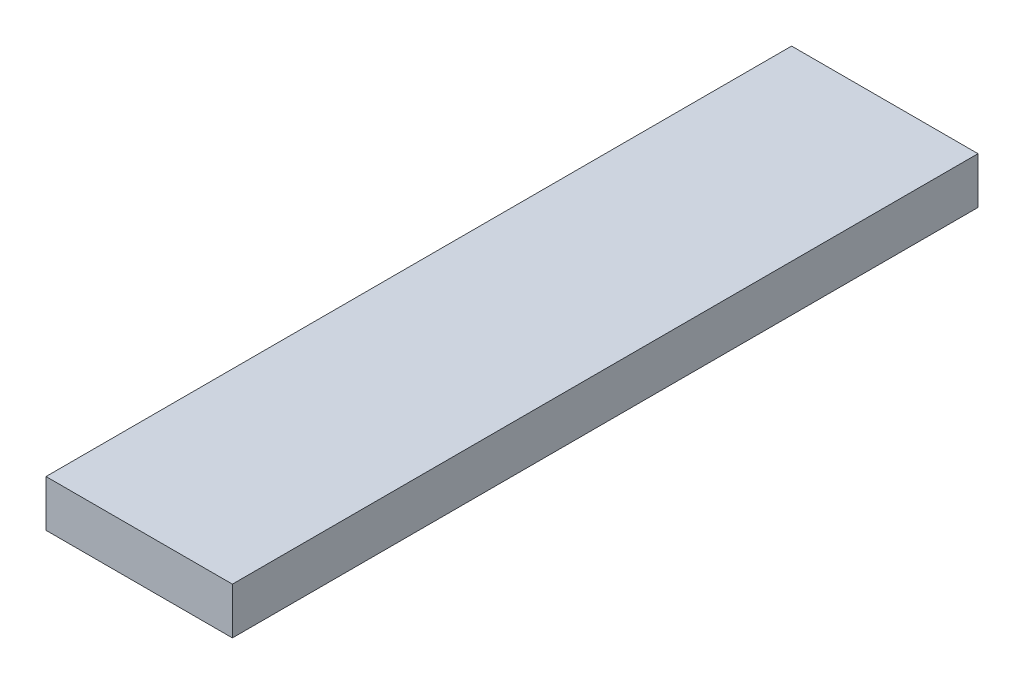
ISO-10303-21;
HEADER;
FILE_DESCRIPTION(('STEP AP214'),'2;1');
FILE_NAME('part.step','',(''),(''),'','','');
FILE_SCHEMA(('AUTOMOTIVE_DESIGN { 1 0 10303 214 1 1 1 1 }'));
ENDSEC;
DATA;
#1=APPLICATION_CONTEXT('core data for automotive mechanical design processes');
#2=APPLICATION_PROTOCOL_DEFINITION('international standard','automotive_design',2000,#1);
#3=PRODUCT_CONTEXT('',#1,'mechanical');
#4=PRODUCT('Part','Part','',(#3));
#5=PRODUCT_RELATED_PRODUCT_CATEGORY('part','',(#4));
#6=PRODUCT_DEFINITION_FORMATION('','',#4);
#7=PRODUCT_DEFINITION_CONTEXT('part definition',#1,'design');
#8=PRODUCT_DEFINITION('design','',#6,#7);
#9=PRODUCT_DEFINITION_SHAPE('','',#8);
#10=(LENGTH_UNIT() NAMED_UNIT(*) SI_UNIT(.MILLI.,.METRE.));
#11=(NAMED_UNIT(*) PLANE_ANGLE_UNIT() SI_UNIT($,.RADIAN.));
#12=(NAMED_UNIT(*) SI_UNIT($,.STERADIAN.) SOLID_ANGLE_UNIT());
#13=UNCERTAINTY_MEASURE_WITH_UNIT(LENGTH_MEASURE(1.E-05),#10,'distance_accuracy_value','');
#14=(GEOMETRIC_REPRESENTATION_CONTEXT(3) GLOBAL_UNCERTAINTY_ASSIGNED_CONTEXT((#13)) GLOBAL_UNIT_ASSIGNED_CONTEXT((#10,
#11,#12)) REPRESENTATION_CONTEXT('',''));
#15=CARTESIAN_POINT('',(0.,0.,0.));
#16=DIRECTION('',(0.,0.,1.));
#17=DIRECTION('',(1.,0.,0.));
#18=AXIS2_PLACEMENT_3D('',#15,#16,#17);
#19=CARTESIAN_POINT('',(41.1334552102375,125.,-921.389396709324));
#20=DIRECTION('',(1.,0.,0.));
#21=DIRECTION('',(0.,0.,-1.));
#22=AXIS2_PLACEMENT_3D('',#19,#20,#21);
#23=PLANE('',#22);
#24=DIRECTION('',(0.,0.,1.));
#25=VECTOR('',#24,1.);
#26=CARTESIAN_POINT('',(41.1334552102375,0.,-921.389396709324));
#27=LINE('',#26,#25);
#28=CARTESIAN_POINT('',(41.1334552102375,0.,-921.389396709324));
#29=VERTEX_POINT('',#28);
#30=CARTESIAN_POINT('',(41.1334552102377,0.,1078.61060329068));
#31=VERTEX_POINT('',#30);
#32=EDGE_CURVE('E100',#29,#31,#27,.T.);
#33=ORIENTED_EDGE('',*,*,#32,.T.);
#34=DIRECTION('',(0.,-1.,0.));
#35=VECTOR('',#34,1.);
#36=CARTESIAN_POINT('',(41.1334552102377,125.,1078.61060329068));
#37=LINE('',#36,#35);
#38=CARTESIAN_POINT('',(41.1334552102377,125.,1078.61060329068));
#39=VERTEX_POINT('',#38);
#40=EDGE_CURVE('E11',#39,#31,#37,.T.);
#41=ORIENTED_EDGE('',*,*,#40,.F.);
#42=DIRECTION('',(0.,0.,1.));
#43=VECTOR('',#42,1.);
#44=CARTESIAN_POINT('',(41.1334552102375,125.,-921.389396709324));
#45=LINE('',#44,#43);
#46=CARTESIAN_POINT('',(41.1334552102375,125.,-921.389396709324));
#47=VERTEX_POINT('',#46);
#48=EDGE_CURVE('E88',#47,#39,#45,.T.);
#49=ORIENTED_EDGE('',*,*,#48,.F.);
#50=DIRECTION('',(0.,-1.,0.));
#51=VECTOR('',#50,1.);
#52=CARTESIAN_POINT('',(41.1334552102375,125.,-921.389396709324));
#53=LINE('',#52,#51);
#54=EDGE_CURVE('E96',#47,#29,#53,.T.);
#55=ORIENTED_EDGE('',*,*,#54,.T.);
#56=EDGE_LOOP('',(#33,#41,#49,#55));
#57=FACE_BOUND('',#56,.T.);
#58=ADVANCED_FACE('F37',(#57),#23,.F.);
#59=CARTESIAN_POINT('',(41.1334552102377,125.,1078.61060329068));
#60=DIRECTION('',(0.,0.,-1.));
#61=DIRECTION('',(-1.,0.,0.));
#62=AXIS2_PLACEMENT_3D('',#59,#60,#61);
#63=PLANE('',#62);
#64=DIRECTION('',(1.,0.,0.));
#65=VECTOR('',#64,1.);
#66=CARTESIAN_POINT('',(41.1334552102377,0.,1078.61060329068));
#67=LINE('',#66,#65);
#68=CARTESIAN_POINT('',(541.133455210238,0.,1078.61060329068));
#69=VERTEX_POINT('',#68);
#70=EDGE_CURVE('E92',#31,#69,#67,.T.);
#71=ORIENTED_EDGE('',*,*,#70,.T.);
#72=DIRECTION('',(0.,-1.,0.));
#73=VECTOR('',#72,1.);
#74=CARTESIAN_POINT('',(541.133455210238,125.,1078.61060329068));
#75=LINE('',#74,#73);
#76=CARTESIAN_POINT('',(541.133455210238,125.,1078.61060329068));
#77=VERTEX_POINT('',#76);
#78=EDGE_CURVE('E45',#77,#69,#75,.T.);
#79=ORIENTED_EDGE('',*,*,#78,.F.);
#80=DIRECTION('',(1.,0.,0.));
#81=VECTOR('',#80,1.);
#82=CARTESIAN_POINT('',(41.1334552102377,125.,1078.61060329068));
#83=LINE('',#82,#81);
#84=EDGE_CURVE('E83',#39,#77,#83,.T.);
#85=ORIENTED_EDGE('',*,*,#84,.F.);
#86=ORIENTED_EDGE('',*,*,#40,.T.);
#87=EDGE_LOOP('',(#71,#79,#85,#86));
#88=FACE_BOUND('',#87,.T.);
#89=ADVANCED_FACE('F91',(#88),#63,.F.);
#90=CARTESIAN_POINT('',(541.133455210238,125.,-921.389396709324));
#91=DIRECTION('',(-1.,0.,0.));
#92=DIRECTION('',(0.,0.,1.));
#93=AXIS2_PLACEMENT_3D('',#90,#91,#92);
#94=PLANE('',#93);
#95=DIRECTION('',(0.,0.,-1.));
#96=VECTOR('',#95,1.);
#97=CARTESIAN_POINT('',(541.133455210238,0.,-921.389396709324));
#98=LINE('',#97,#96);
#99=CARTESIAN_POINT('',(541.133455210238,0.,-921.389396709324));
#100=VERTEX_POINT('',#99);
#101=EDGE_CURVE('E70',#69,#100,#98,.T.);
#102=ORIENTED_EDGE('',*,*,#101,.T.);
#103=DIRECTION('',(0.,-1.,0.));
#104=VECTOR('',#103,1.);
#105=CARTESIAN_POINT('',(541.133455210238,125.,-921.389396709324));
#106=LINE('',#105,#104);
#107=CARTESIAN_POINT('',(541.133455210238,125.,-921.389396709324));
#108=VERTEX_POINT('',#107);
#109=EDGE_CURVE('E93',#108,#100,#106,.T.);
#110=ORIENTED_EDGE('',*,*,#109,.F.);
#111=DIRECTION('',(0.,0.,-1.));
#112=VECTOR('',#111,1.);
#113=CARTESIAN_POINT('',(541.133455210238,125.,-921.389396709324));
#114=LINE('',#113,#112);
#115=EDGE_CURVE('E86',#77,#108,#114,.T.);
#116=ORIENTED_EDGE('',*,*,#115,.F.);
#117=ORIENTED_EDGE('',*,*,#78,.T.);
#118=EDGE_LOOP('',(#102,#110,#116,#117));
#119=FACE_BOUND('',#118,.T.);
#120=ADVANCED_FACE('F94',(#119),#94,.F.);
#121=CARTESIAN_POINT('',(41.1334552102375,125.,-921.389396709324));
#122=DIRECTION('',(0.,0.,1.));
#123=DIRECTION('',(1.,0.,0.));
#124=AXIS2_PLACEMENT_3D('',#121,#122,#123);
#125=PLANE('',#124);
#126=DIRECTION('',(-1.,0.,0.));
#127=VECTOR('',#126,1.);
#128=CARTESIAN_POINT('',(41.1334552102375,0.,-921.389396709324));
#129=LINE('',#128,#127);
#130=EDGE_CURVE('E76',#100,#29,#129,.T.);
#131=ORIENTED_EDGE('',*,*,#130,.T.);
#132=ORIENTED_EDGE('',*,*,#54,.F.);
#133=DIRECTION('',(-1.,0.,0.));
#134=VECTOR('',#133,1.);
#135=CARTESIAN_POINT('',(41.1334552102375,125.,-921.389396709324));
#136=LINE('',#135,#134);
#137=EDGE_CURVE('E53',#108,#47,#136,.T.);
#138=ORIENTED_EDGE('',*,*,#137,.F.);
#139=ORIENTED_EDGE('',*,*,#109,.T.);
#140=EDGE_LOOP('',(#131,#132,#138,#139));
#141=FACE_BOUND('',#140,.T.);
#142=ADVANCED_FACE('F107',(#141),#125,.F.);
#143=CARTESIAN_POINT('',(0.,125.,0.));
#144=DIRECTION('',(0.,1.,0.));
#145=DIRECTION('',(0.,0.,1.));
#146=AXIS2_PLACEMENT_3D('',#143,#144,#145);
#147=PLANE('',#146);
#148=ORIENTED_EDGE('',*,*,#48,.T.);
#149=ORIENTED_EDGE('',*,*,#84,.T.);
#150=ORIENTED_EDGE('',*,*,#115,.T.);
#151=ORIENTED_EDGE('',*,*,#137,.T.);
#152=EDGE_LOOP('',(#148,#149,#150,#151));
#153=FACE_BOUND('',#152,.T.);
#154=ADVANCED_FACE('F84',(#153),#147,.T.);
#155=CARTESIAN_POINT('',(0.,0.,0.));
#156=DIRECTION('',(0.,1.,0.));
#157=DIRECTION('',(0.,0.,1.));
#158=AXIS2_PLACEMENT_3D('',#155,#156,#157);
#159=PLANE('',#158);
#160=ORIENTED_EDGE('',*,*,#32,.F.);
#161=ORIENTED_EDGE('',*,*,#130,.F.);
#162=ORIENTED_EDGE('',*,*,#101,.F.);
#163=ORIENTED_EDGE('',*,*,#70,.F.);
#164=EDGE_LOOP('',(#160,#161,#162,#163));
#165=FACE_BOUND('',#164,.T.);
#166=ADVANCED_FACE('F110',(#165),#159,.F.);
#167=CLOSED_SHELL('',(#58,#89,#120,#142,#154,#166));
#168=MANIFOLD_SOLID_BREP('B2',#167);
#169=ADVANCED_BREP_SHAPE_REPRESENTATION('',(#18,#168),#14);
#170=SHAPE_DEFINITION_REPRESENTATION(#9,#169);
ENDSEC;
END-ISO-10303-21;
